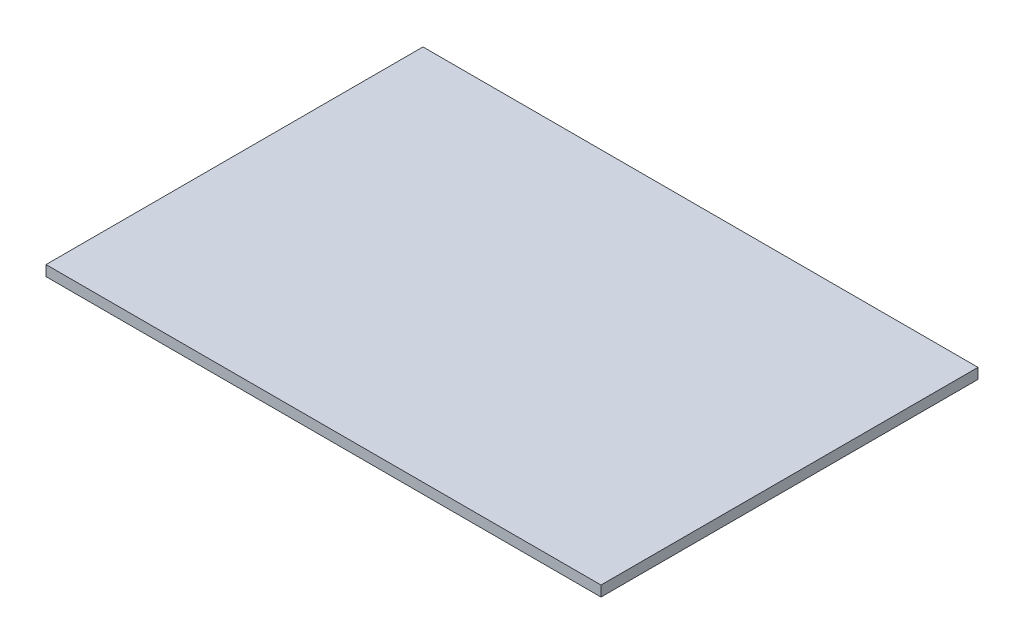
ISO-10303-21;
HEADER;
FILE_DESCRIPTION(('STEP AP214'),'2;1');
FILE_NAME('part.step','',(''),(''),'','','');
FILE_SCHEMA(('AUTOMOTIVE_DESIGN { 1 0 10303 214 1 1 1 1 }'));
ENDSEC;
DATA;
#1=APPLICATION_CONTEXT('core data for automotive mechanical design processes');
#2=APPLICATION_PROTOCOL_DEFINITION('international standard','automotive_design',2000,#1);
#3=PRODUCT_CONTEXT('',#1,'mechanical');
#4=PRODUCT('Part','Part','',(#3));
#5=PRODUCT_RELATED_PRODUCT_CATEGORY('part','',(#4));
#6=PRODUCT_DEFINITION_FORMATION('','',#4);
#7=PRODUCT_DEFINITION_CONTEXT('part definition',#1,'design');
#8=PRODUCT_DEFINITION('design','',#6,#7);
#9=PRODUCT_DEFINITION_SHAPE('','',#8);
#10=(LENGTH_UNIT() NAMED_UNIT(*) SI_UNIT(.MILLI.,.METRE.));
#11=(NAMED_UNIT(*) PLANE_ANGLE_UNIT() SI_UNIT($,.RADIAN.));
#12=(NAMED_UNIT(*) SI_UNIT($,.STERADIAN.) SOLID_ANGLE_UNIT());
#13=UNCERTAINTY_MEASURE_WITH_UNIT(LENGTH_MEASURE(1.E-05),#10,'distance_accuracy_value','');
#14=(GEOMETRIC_REPRESENTATION_CONTEXT(3) GLOBAL_UNCERTAINTY_ASSIGNED_CONTEXT((#13)) GLOBAL_UNIT_ASSIGNED_CONTEXT((#10,
#11,#12)) REPRESENTATION_CONTEXT('',''));
#15=CARTESIAN_POINT('',(0.,0.,0.));
#16=DIRECTION('',(0.,0.,1.));
#17=DIRECTION('',(1.,0.,0.));
#18=AXIS2_PLACEMENT_3D('',#15,#16,#17);
#19=CARTESIAN_POINT('',(265.,10.,-180.));
#20=DIRECTION('',(-1.,0.,0.));
#21=DIRECTION('',(0.,0.,1.));
#22=AXIS2_PLACEMENT_3D('',#19,#20,#21);
#23=PLANE('',#22);
#24=DIRECTION('',(0.,0.,-1.));
#25=VECTOR('',#24,1.);
#26=CARTESIAN_POINT('',(265.,0.,-180.));
#27=LINE('',#26,#25);
#28=CARTESIAN_POINT('',(265.,0.,180.));
#29=VERTEX_POINT('',#28);
#30=CARTESIAN_POINT('',(265.,0.,-180.));
#31=VERTEX_POINT('',#30);
#32=EDGE_CURVE('E99',#29,#31,#27,.T.);
#33=ORIENTED_EDGE('',*,*,#32,.T.);
#34=DIRECTION('',(0.,-1.,0.));
#35=VECTOR('',#34,1.);
#36=CARTESIAN_POINT('',(265.,10.,-180.));
#37=LINE('',#36,#35);
#38=CARTESIAN_POINT('',(265.,10.,-180.));
#39=VERTEX_POINT('',#38);
#40=EDGE_CURVE('E11',#39,#31,#37,.T.);
#41=ORIENTED_EDGE('',*,*,#40,.F.);
#42=DIRECTION('',(0.,0.,-1.));
#43=VECTOR('',#42,1.);
#44=CARTESIAN_POINT('',(265.,10.,-180.));
#45=LINE('',#44,#43);
#46=CARTESIAN_POINT('',(265.,10.,180.));
#47=VERTEX_POINT('',#46);
#48=EDGE_CURVE('E87',#47,#39,#45,.T.);
#49=ORIENTED_EDGE('',*,*,#48,.F.);
#50=DIRECTION('',(0.,-1.,0.));
#51=VECTOR('',#50,1.);
#52=CARTESIAN_POINT('',(265.,10.,180.));
#53=LINE('',#52,#51);
#54=EDGE_CURVE('E95',#47,#29,#53,.T.);
#55=ORIENTED_EDGE('',*,*,#54,.T.);
#56=EDGE_LOOP('',(#33,#41,#49,#55));
#57=FACE_BOUND('',#56,.T.);
#58=ADVANCED_FACE('F36',(#57),#23,.F.);
#59=CARTESIAN_POINT('',(-265.,10.,-180.));
#60=DIRECTION('',(0.,0.,1.));
#61=DIRECTION('',(1.,0.,0.));
#62=AXIS2_PLACEMENT_3D('',#59,#60,#61);
#63=PLANE('',#62);
#64=DIRECTION('',(-1.,0.,0.));
#65=VECTOR('',#64,1.);
#66=CARTESIAN_POINT('',(-265.,0.,-180.));
#67=LINE('',#66,#65);
#68=CARTESIAN_POINT('',(-265.,0.,-180.));
#69=VERTEX_POINT('',#68);
#70=EDGE_CURVE('E91',#31,#69,#67,.T.);
#71=ORIENTED_EDGE('',*,*,#70,.T.);
#72=DIRECTION('',(0.,-1.,0.));
#73=VECTOR('',#72,1.);
#74=CARTESIAN_POINT('',(-265.,10.,-180.));
#75=LINE('',#74,#73);
#76=CARTESIAN_POINT('',(-265.,10.,-180.));
#77=VERTEX_POINT('',#76);
#78=EDGE_CURVE('E44',#77,#69,#75,.T.);
#79=ORIENTED_EDGE('',*,*,#78,.F.);
#80=DIRECTION('',(-1.,0.,0.));
#81=VECTOR('',#80,1.);
#82=CARTESIAN_POINT('',(-265.,10.,-180.));
#83=LINE('',#82,#81);
#84=EDGE_CURVE('E82',#39,#77,#83,.T.);
#85=ORIENTED_EDGE('',*,*,#84,.F.);
#86=ORIENTED_EDGE('',*,*,#40,.T.);
#87=EDGE_LOOP('',(#71,#79,#85,#86));
#88=FACE_BOUND('',#87,.T.);
#89=ADVANCED_FACE('F90',(#88),#63,.F.);
#90=CARTESIAN_POINT('',(-265.,10.,-180.));
#91=DIRECTION('',(1.,0.,0.));
#92=DIRECTION('',(0.,0.,-1.));
#93=AXIS2_PLACEMENT_3D('',#90,#91,#92);
#94=PLANE('',#93);
#95=DIRECTION('',(0.,0.,1.));
#96=VECTOR('',#95,1.);
#97=CARTESIAN_POINT('',(-265.,0.,-180.));
#98=LINE('',#97,#96);
#99=CARTESIAN_POINT('',(-265.,0.,180.));
#100=VERTEX_POINT('',#99);
#101=EDGE_CURVE('E69',#69,#100,#98,.T.);
#102=ORIENTED_EDGE('',*,*,#101,.T.);
#103=DIRECTION('',(0.,-1.,0.));
#104=VECTOR('',#103,1.);
#105=CARTESIAN_POINT('',(-265.,10.,180.));
#106=LINE('',#105,#104);
#107=CARTESIAN_POINT('',(-265.,10.,180.));
#108=VERTEX_POINT('',#107);
#109=EDGE_CURVE('E92',#108,#100,#106,.T.);
#110=ORIENTED_EDGE('',*,*,#109,.F.);
#111=DIRECTION('',(0.,0.,1.));
#112=VECTOR('',#111,1.);
#113=CARTESIAN_POINT('',(-265.,10.,-180.));
#114=LINE('',#113,#112);
#115=EDGE_CURVE('E85',#77,#108,#114,.T.);
#116=ORIENTED_EDGE('',*,*,#115,.F.);
#117=ORIENTED_EDGE('',*,*,#78,.T.);
#118=EDGE_LOOP('',(#102,#110,#116,#117));
#119=FACE_BOUND('',#118,.T.);
#120=ADVANCED_FACE('F93',(#119),#94,.F.);
#121=CARTESIAN_POINT('',(-265.,10.,180.));
#122=DIRECTION('',(0.,0.,-1.));
#123=DIRECTION('',(-1.,0.,0.));
#124=AXIS2_PLACEMENT_3D('',#121,#122,#123);
#125=PLANE('',#124);
#126=DIRECTION('',(1.,0.,0.));
#127=VECTOR('',#126,1.);
#128=CARTESIAN_POINT('',(-265.,0.,180.));
#129=LINE('',#128,#127);
#130=EDGE_CURVE('E75',#100,#29,#129,.T.);
#131=ORIENTED_EDGE('',*,*,#130,.T.);
#132=ORIENTED_EDGE('',*,*,#54,.F.);
#133=DIRECTION('',(1.,0.,0.));
#134=VECTOR('',#133,1.);
#135=CARTESIAN_POINT('',(-265.,10.,180.));
#136=LINE('',#135,#134);
#137=EDGE_CURVE('E52',#108,#47,#136,.T.);
#138=ORIENTED_EDGE('',*,*,#137,.F.);
#139=ORIENTED_EDGE('',*,*,#109,.T.);
#140=EDGE_LOOP('',(#131,#132,#138,#139));
#141=FACE_BOUND('',#140,.T.);
#142=ADVANCED_FACE('F106',(#141),#125,.F.);
#143=CARTESIAN_POINT('',(0.,10.,0.));
#144=DIRECTION('',(0.,1.,0.));
#145=DIRECTION('',(0.,0.,1.));
#146=AXIS2_PLACEMENT_3D('',#143,#144,#145);
#147=PLANE('',#146);
#148=ORIENTED_EDGE('',*,*,#48,.T.);
#149=ORIENTED_EDGE('',*,*,#84,.T.);
#150=ORIENTED_EDGE('',*,*,#115,.T.);
#151=ORIENTED_EDGE('',*,*,#137,.T.);
#152=EDGE_LOOP('',(#148,#149,#150,#151));
#153=FACE_BOUND('',#152,.T.);
#154=ADVANCED_FACE('F83',(#153),#147,.T.);
#155=CARTESIAN_POINT('',(0.,0.,0.));
#156=DIRECTION('',(0.,1.,0.));
#157=DIRECTION('',(0.,0.,1.));
#158=AXIS2_PLACEMENT_3D('',#155,#156,#157);
#159=PLANE('',#158);
#160=ORIENTED_EDGE('',*,*,#32,.F.);
#161=ORIENTED_EDGE('',*,*,#130,.F.);
#162=ORIENTED_EDGE('',*,*,#101,.F.);
#163=ORIENTED_EDGE('',*,*,#70,.F.);
#164=EDGE_LOOP('',(#160,#161,#162,#163));
#165=FACE_BOUND('',#164,.T.);
#166=ADVANCED_FACE('F109',(#165),#159,.F.);
#167=CLOSED_SHELL('',(#58,#89,#120,#142,#154,#166));
#168=MANIFOLD_SOLID_BREP('B2',#167);
#169=ADVANCED_BREP_SHAPE_REPRESENTATION('',(#18,#168),#14);
#170=SHAPE_DEFINITION_REPRESENTATION(#9,#169);
ENDSEC;
END-ISO-10303-21;
